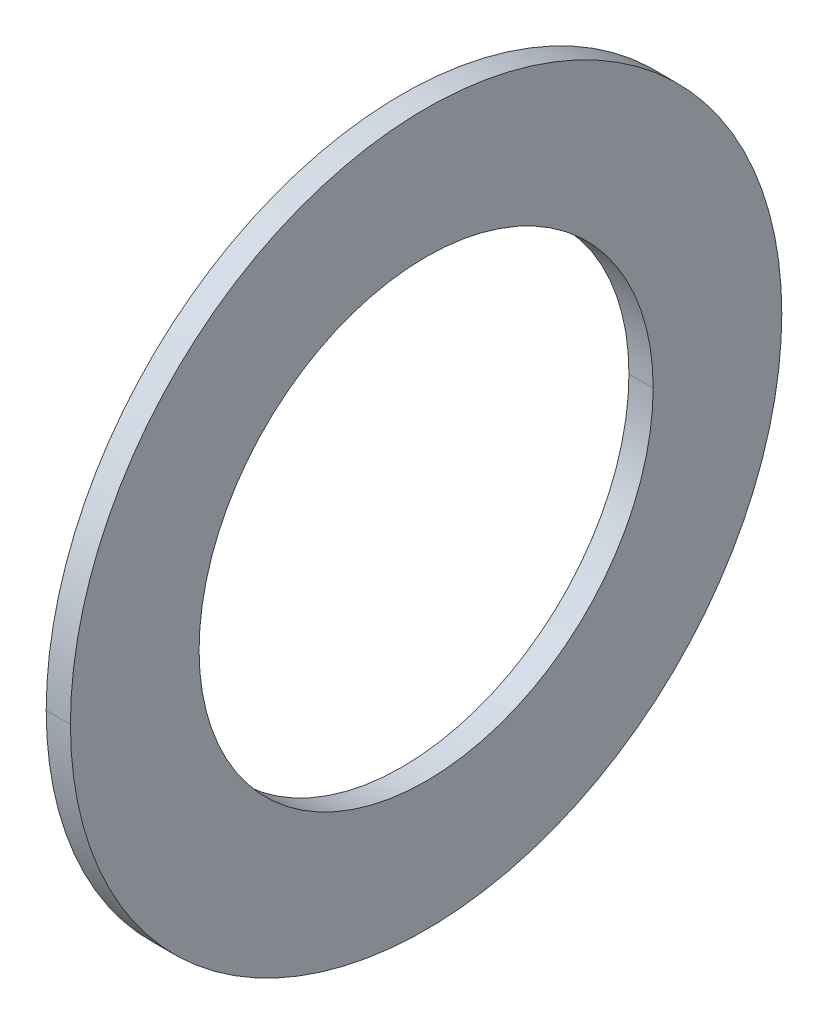
ISO-10303-21;
HEADER;
FILE_DESCRIPTION(('STEP AP214'),'2;1');
FILE_NAME('part.step','',(''),(''),'','','');
FILE_SCHEMA(('AUTOMOTIVE_DESIGN { 1 0 10303 214 1 1 1 1 }'));
ENDSEC;
DATA;
#1=APPLICATION_CONTEXT('core data for automotive mechanical design processes');
#2=APPLICATION_PROTOCOL_DEFINITION('international standard','automotive_design',2000,#1);
#3=PRODUCT_CONTEXT('',#1,'mechanical');
#4=PRODUCT('Part','Part','',(#3));
#5=PRODUCT_RELATED_PRODUCT_CATEGORY('part','',(#4));
#6=PRODUCT_DEFINITION_FORMATION('','',#4);
#7=PRODUCT_DEFINITION_CONTEXT('part definition',#1,'design');
#8=PRODUCT_DEFINITION('design','',#6,#7);
#9=PRODUCT_DEFINITION_SHAPE('','',#8);
#10=(LENGTH_UNIT() NAMED_UNIT(*) SI_UNIT(.MILLI.,.METRE.));
#11=(NAMED_UNIT(*) PLANE_ANGLE_UNIT() SI_UNIT($,.RADIAN.));
#12=(NAMED_UNIT(*) SI_UNIT($,.STERADIAN.) SOLID_ANGLE_UNIT());
#13=UNCERTAINTY_MEASURE_WITH_UNIT(LENGTH_MEASURE(1.E-05),#10,'distance_accuracy_value','');
#14=(GEOMETRIC_REPRESENTATION_CONTEXT(3) GLOBAL_UNCERTAINTY_ASSIGNED_CONTEXT((#13)) GLOBAL_UNIT_ASSIGNED_CONTEXT((#10,
#11,#12)) REPRESENTATION_CONTEXT('',''));
#15=CARTESIAN_POINT('',(0.,0.,0.));
#16=DIRECTION('',(0.,0.,1.));
#17=DIRECTION('',(1.,0.,0.));
#18=AXIS2_PLACEMENT_3D('',#15,#16,#17);
#19=CARTESIAN_POINT('',(0.8,0.,0.));
#20=DIRECTION('',(-1.,0.,0.));
#21=DIRECTION('',(0.,1.,0.));
#22=AXIS2_PLACEMENT_3D('',#19,#20,#21);
#23=CYLINDRICAL_SURFACE('',#22,15.);
#24=DIRECTION('',(-1.,0.,0.));
#25=VECTOR('',#24,1.);
#26=CARTESIAN_POINT('',(0.8,0.,-15.));
#27=LINE('',#26,#25);
#28=CARTESIAN_POINT('',(0.8,0.,-15.));
#29=VERTEX_POINT('',#28);
#30=CARTESIAN_POINT('',(-0.8,0.,-15.));
#31=VERTEX_POINT('',#30);
#32=EDGE_CURVE('E11',#29,#31,#27,.T.);
#33=ORIENTED_EDGE('',*,*,#32,.T.);
#34=CARTESIAN_POINT('',(-0.8,0.,0.));
#35=DIRECTION('',(1.,0.,0.));
#36=DIRECTION('',(0.,0.,-1.));
#37=AXIS2_PLACEMENT_3D('',#34,#35,#36);
#38=CIRCLE('',#37,15.);
#39=CARTESIAN_POINT('',(-0.8,0.,15.));
#40=VERTEX_POINT('',#39);
#41=EDGE_CURVE('E25',#40,#31,#38,.T.);
#42=ORIENTED_EDGE('',*,*,#41,.F.);
#43=DIRECTION('',(-1.,0.,0.));
#44=VECTOR('',#43,1.);
#45=CARTESIAN_POINT('',(0.8,0.,15.));
#46=LINE('',#45,#44);
#47=CARTESIAN_POINT('',(0.8,0.,15.));
#48=VERTEX_POINT('',#47);
#49=EDGE_CURVE('E94',#48,#40,#46,.T.);
#50=ORIENTED_EDGE('',*,*,#49,.F.);
#51=CARTESIAN_POINT('',(0.8,0.,0.));
#52=DIRECTION('',(1.,0.,0.));
#53=DIRECTION('',(0.,0.,-1.));
#54=AXIS2_PLACEMENT_3D('',#51,#52,#53);
#55=CIRCLE('',#54,15.);
#56=EDGE_CURVE('E90',#48,#29,#55,.T.);
#57=ORIENTED_EDGE('',*,*,#56,.T.);
#58=EDGE_LOOP('',(#33,#42,#50,#57));
#59=FACE_BOUND('',#58,.T.);
#60=ADVANCED_FACE('F17',(#59),#23,.F.);
#61=CARTESIAN_POINT('',(0.8,0.,0.));
#62=DIRECTION('',(1.,0.,0.));
#63=DIRECTION('',(0.,0.,-1.));
#64=AXIS2_PLACEMENT_3D('',#61,#62,#63);
#65=PLANE('',#64);
#66=ORIENTED_EDGE('',*,*,#56,.F.);
#67=CARTESIAN_POINT('',(0.8,0.,0.));
#68=DIRECTION('',(1.,0.,0.));
#69=DIRECTION('',(0.,0.,-1.));
#70=AXIS2_PLACEMENT_3D('',#67,#68,#69);
#71=CIRCLE('',#70,15.);
#72=EDGE_CURVE('E85',#29,#48,#71,.T.);
#73=ORIENTED_EDGE('',*,*,#72,.F.);
#74=EDGE_LOOP('',(#66,#73));
#75=FACE_BOUND('',#74,.T.);
#76=CARTESIAN_POINT('',(0.8,0.,0.));
#77=DIRECTION('',(1.,0.,0.));
#78=DIRECTION('',(0.,0.,-1.));
#79=AXIS2_PLACEMENT_3D('',#76,#77,#78);
#80=CIRCLE('',#79,23.5);
#81=CARTESIAN_POINT('',(0.8,0.,-23.5));
#82=VERTEX_POINT('',#81);
#83=CARTESIAN_POINT('',(0.8,0.,23.5));
#84=VERTEX_POINT('',#83);
#85=EDGE_CURVE('E72',#82,#84,#80,.T.);
#86=ORIENTED_EDGE('',*,*,#85,.T.);
#87=CARTESIAN_POINT('',(0.8,0.,0.));
#88=DIRECTION('',(1.,0.,0.));
#89=DIRECTION('',(0.,0.,-1.));
#90=AXIS2_PLACEMENT_3D('',#87,#88,#89);
#91=CIRCLE('',#90,23.5);
#92=EDGE_CURVE('E73',#84,#82,#91,.T.);
#93=ORIENTED_EDGE('',*,*,#92,.T.);
#94=EDGE_LOOP('',(#86,#93));
#95=FACE_BOUND('',#94,.T.);
#96=ADVANCED_FACE('F116',(#75,#95),#65,.T.);
#97=CARTESIAN_POINT('',(0.8,0.,0.));
#98=DIRECTION('',(-1.,0.,0.));
#99=DIRECTION('',(0.,1.,0.));
#100=AXIS2_PLACEMENT_3D('',#97,#98,#99);
#101=CYLINDRICAL_SURFACE('',#100,23.5);
#102=DIRECTION('',(-1.,0.,0.));
#103=VECTOR('',#102,1.);
#104=CARTESIAN_POINT('',(0.8,0.,-23.5));
#105=LINE('',#104,#103);
#106=CARTESIAN_POINT('',(-0.8,0.,-23.5));
#107=VERTEX_POINT('',#106);
#108=EDGE_CURVE('E59',#82,#107,#105,.T.);
#109=ORIENTED_EDGE('',*,*,#108,.F.);
#110=ORIENTED_EDGE('',*,*,#92,.F.);
#111=DIRECTION('',(-1.,0.,0.));
#112=VECTOR('',#111,1.);
#113=CARTESIAN_POINT('',(0.8,0.,23.5));
#114=LINE('',#113,#112);
#115=CARTESIAN_POINT('',(-0.8,0.,23.5));
#116=VERTEX_POINT('',#115);
#117=EDGE_CURVE('E61',#84,#116,#114,.T.);
#118=ORIENTED_EDGE('',*,*,#117,.T.);
#119=CARTESIAN_POINT('',(-0.8,0.,0.));
#120=DIRECTION('',(1.,0.,0.));
#121=DIRECTION('',(0.,0.,-1.));
#122=AXIS2_PLACEMENT_3D('',#119,#120,#121);
#123=CIRCLE('',#122,23.5);
#124=EDGE_CURVE('E54',#116,#107,#123,.T.);
#125=ORIENTED_EDGE('',*,*,#124,.T.);
#126=EDGE_LOOP('',(#109,#110,#118,#125));
#127=FACE_BOUND('',#126,.T.);
#128=ADVANCED_FACE('F56',(#127),#101,.T.);
#129=CARTESIAN_POINT('',(-0.8,0.,0.));
#130=DIRECTION('',(1.,0.,0.));
#131=DIRECTION('',(0.,0.,-1.));
#132=AXIS2_PLACEMENT_3D('',#129,#130,#131);
#133=PLANE('',#132);
#134=CARTESIAN_POINT('',(-0.8,0.,0.));
#135=DIRECTION('',(1.,0.,0.));
#136=DIRECTION('',(0.,0.,-1.));
#137=AXIS2_PLACEMENT_3D('',#134,#135,#136);
#138=CIRCLE('',#137,15.);
#139=EDGE_CURVE('E64',#31,#40,#138,.T.);
#140=ORIENTED_EDGE('',*,*,#139,.T.);
#141=ORIENTED_EDGE('',*,*,#41,.T.);
#142=EDGE_LOOP('',(#140,#141));
#143=FACE_BOUND('',#142,.T.);
#144=ORIENTED_EDGE('',*,*,#124,.F.);
#145=CARTESIAN_POINT('',(-0.8,0.,0.));
#146=DIRECTION('',(1.,0.,0.));
#147=DIRECTION('',(0.,0.,-1.));
#148=AXIS2_PLACEMENT_3D('',#145,#146,#147);
#149=CIRCLE('',#148,23.5);
#150=EDGE_CURVE('E66',#107,#116,#149,.T.);
#151=ORIENTED_EDGE('',*,*,#150,.F.);
#152=EDGE_LOOP('',(#144,#151));
#153=FACE_BOUND('',#152,.T.);
#154=ADVANCED_FACE('F67',(#143,#153),#133,.F.);
#155=CARTESIAN_POINT('',(0.8,0.,0.));
#156=DIRECTION('',(-1.,0.,0.));
#157=DIRECTION('',(0.,-1.,0.));
#158=AXIS2_PLACEMENT_3D('',#155,#156,#157);
#159=CYLINDRICAL_SURFACE('',#158,23.5);
#160=ORIENTED_EDGE('',*,*,#108,.T.);
#161=ORIENTED_EDGE('',*,*,#150,.T.);
#162=ORIENTED_EDGE('',*,*,#117,.F.);
#163=ORIENTED_EDGE('',*,*,#85,.F.);
#164=EDGE_LOOP('',(#160,#161,#162,#163));
#165=FACE_BOUND('',#164,.T.);
#166=ADVANCED_FACE('F71',(#165),#159,.T.);
#167=CARTESIAN_POINT('',(0.8,0.,0.));
#168=DIRECTION('',(-1.,0.,0.));
#169=DIRECTION('',(0.,-1.,0.));
#170=AXIS2_PLACEMENT_3D('',#167,#168,#169);
#171=CYLINDRICAL_SURFACE('',#170,15.);
#172=ORIENTED_EDGE('',*,*,#32,.F.);
#173=ORIENTED_EDGE('',*,*,#72,.T.);
#174=ORIENTED_EDGE('',*,*,#49,.T.);
#175=ORIENTED_EDGE('',*,*,#139,.F.);
#176=EDGE_LOOP('',(#172,#173,#174,#175));
#177=FACE_BOUND('',#176,.T.);
#178=ADVANCED_FACE('F112',(#177),#171,.F.);
#179=CLOSED_SHELL('',(#60,#96,#128,#154,#166,#178));
#180=MANIFOLD_SOLID_BREP('B1',#179);
#181=ADVANCED_BREP_SHAPE_REPRESENTATION('',(#18,#180),#14);
#182=SHAPE_DEFINITION_REPRESENTATION(#9,#181);
ENDSEC;
END-ISO-10303-21;
